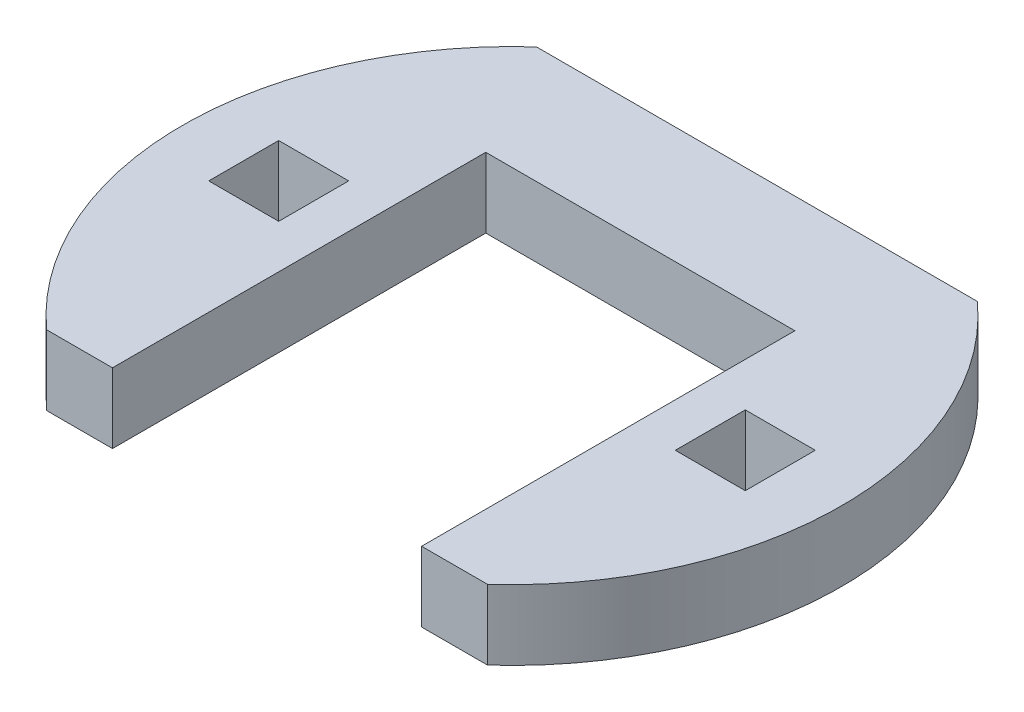
ISO-10303-21;
HEADER;
FILE_DESCRIPTION(('STEP AP214'),'2;1');
FILE_NAME('part.step','',(''),(''),'','','');
FILE_SCHEMA(('AUTOMOTIVE_DESIGN { 1 0 10303 214 1 1 1 1 }'));
ENDSEC;
DATA;
#1=APPLICATION_CONTEXT('core data for automotive mechanical design processes');
#2=APPLICATION_PROTOCOL_DEFINITION('international standard','automotive_design',2000,#1);
#3=PRODUCT_CONTEXT('',#1,'mechanical');
#4=PRODUCT('Part','Part','',(#3));
#5=PRODUCT_RELATED_PRODUCT_CATEGORY('part','',(#4));
#6=PRODUCT_DEFINITION_FORMATION('','',#4);
#7=PRODUCT_DEFINITION_CONTEXT('part definition',#1,'design');
#8=PRODUCT_DEFINITION('design','',#6,#7);
#9=PRODUCT_DEFINITION_SHAPE('','',#8);
#10=(LENGTH_UNIT() NAMED_UNIT(*) SI_UNIT(.MILLI.,.METRE.));
#11=(NAMED_UNIT(*) PLANE_ANGLE_UNIT() SI_UNIT($,.RADIAN.));
#12=(NAMED_UNIT(*) SI_UNIT($,.STERADIAN.) SOLID_ANGLE_UNIT());
#13=UNCERTAINTY_MEASURE_WITH_UNIT(LENGTH_MEASURE(1.E-05),#10,'distance_accuracy_value','');
#14=(GEOMETRIC_REPRESENTATION_CONTEXT(3) GLOBAL_UNCERTAINTY_ASSIGNED_CONTEXT((#13)) GLOBAL_UNIT_ASSIGNED_CONTEXT((#10,
#11,#12)) REPRESENTATION_CONTEXT('',''));
#15=CARTESIAN_POINT('',(0.,0.,0.));
#16=DIRECTION('',(0.,0.,1.));
#17=DIRECTION('',(1.,0.,0.));
#18=AXIS2_PLACEMENT_3D('',#15,#16,#17);
#19=CARTESIAN_POINT('',(23.,6.,3.00000000000001));
#20=DIRECTION('',(1.,0.,0.));
#21=DIRECTION('',(0.,0.,-1.));
#22=AXIS2_PLACEMENT_3D('',#19,#20,#21);
#23=PLANE('',#22);
#24=DIRECTION('',(0.,-1.,0.));
#25=VECTOR('',#24,1.);
#26=CARTESIAN_POINT('',(23.,6.,-2.99999999999999));
#27=LINE('',#26,#25);
#28=CARTESIAN_POINT('',(23.,-6.,-2.99999999999999));
#29=VERTEX_POINT('',#28);
#30=CARTESIAN_POINT('',(23.,-12.,-2.99999999999999));
#31=VERTEX_POINT('',#30);
#32=EDGE_CURVE('E239',#29,#31,#27,.T.);
#33=ORIENTED_EDGE('',*,*,#32,.T.);
#34=DIRECTION('',(0.,0.,1.));
#35=VECTOR('',#34,1.);
#36=CARTESIAN_POINT('',(23.,-12.,3.00000000000001));
#37=LINE('',#36,#35);
#38=CARTESIAN_POINT('',(23.,-12.,3.00000000000001));
#39=VERTEX_POINT('',#38);
#40=EDGE_CURVE('E263',#31,#39,#37,.T.);
#41=ORIENTED_EDGE('',*,*,#40,.T.);
#42=DIRECTION('',(0.,-1.,0.));
#43=VECTOR('',#42,1.);
#44=CARTESIAN_POINT('',(23.,6.,3.00000000000001));
#45=LINE('',#44,#43);
#46=CARTESIAN_POINT('',(23.,-6.,3.00000000000001));
#47=VERTEX_POINT('',#46);
#48=EDGE_CURVE('E229',#47,#39,#45,.T.);
#49=ORIENTED_EDGE('',*,*,#48,.F.);
#50=DIRECTION('',(0.,0.,1.));
#51=VECTOR('',#50,1.);
#52=CARTESIAN_POINT('',(23.,-6.,3.00000000000001));
#53=LINE('',#52,#51);
#54=EDGE_CURVE('E233',#29,#47,#53,.T.);
#55=ORIENTED_EDGE('',*,*,#54,.F.);
#56=EDGE_LOOP('',(#33,#41,#49,#55));
#57=FACE_BOUND('',#56,.T.);
#58=ADVANCED_FACE('F37',(#57),#23,.F.);
#59=CARTESIAN_POINT('',(23.,6.,-2.99999999999999));
#60=DIRECTION('',(0.,0.,-1.));
#61=DIRECTION('',(-1.,0.,0.));
#62=AXIS2_PLACEMENT_3D('',#59,#60,#61);
#63=PLANE('',#62);
#64=DIRECTION('',(0.,-1.,0.));
#65=VECTOR('',#64,1.);
#66=CARTESIAN_POINT('',(17.,6.,-2.99999999999999));
#67=LINE('',#66,#65);
#68=CARTESIAN_POINT('',(17.,-6.,-2.99999999999999));
#69=VERTEX_POINT('',#68);
#70=CARTESIAN_POINT('',(17.,-12.,-2.99999999999999));
#71=VERTEX_POINT('',#70);
#72=EDGE_CURVE('E236',#69,#71,#67,.T.);
#73=ORIENTED_EDGE('',*,*,#72,.T.);
#74=DIRECTION('',(1.,0.,0.));
#75=VECTOR('',#74,1.);
#76=CARTESIAN_POINT('',(23.,-12.,-2.99999999999999));
#77=LINE('',#76,#75);
#78=EDGE_CURVE('E266',#71,#31,#77,.T.);
#79=ORIENTED_EDGE('',*,*,#78,.T.);
#80=ORIENTED_EDGE('',*,*,#32,.F.);
#81=DIRECTION('',(1.,0.,0.));
#82=VECTOR('',#81,1.);
#83=CARTESIAN_POINT('',(23.,-6.,-2.99999999999999));
#84=LINE('',#83,#82);
#85=EDGE_CURVE('E251',#69,#29,#84,.T.);
#86=ORIENTED_EDGE('',*,*,#85,.F.);
#87=EDGE_LOOP('',(#73,#79,#80,#86));
#88=FACE_BOUND('',#87,.T.);
#89=ADVANCED_FACE('F304',(#88),#63,.F.);
#90=CARTESIAN_POINT('',(17.,6.,3.00000000000001));
#91=DIRECTION('',(-1.,0.,0.));
#92=DIRECTION('',(0.,0.,1.));
#93=AXIS2_PLACEMENT_3D('',#90,#91,#92);
#94=PLANE('',#93);
#95=DIRECTION('',(0.,-1.,0.));
#96=VECTOR('',#95,1.);
#97=CARTESIAN_POINT('',(17.,6.,3.00000000000001));
#98=LINE('',#97,#96);
#99=CARTESIAN_POINT('',(17.,-6.,3.00000000000001));
#100=VERTEX_POINT('',#99);
#101=CARTESIAN_POINT('',(17.,-12.,3.00000000000001));
#102=VERTEX_POINT('',#101);
#103=EDGE_CURVE('E232',#100,#102,#98,.T.);
#104=ORIENTED_EDGE('',*,*,#103,.T.);
#105=DIRECTION('',(0.,0.,-1.));
#106=VECTOR('',#105,1.);
#107=CARTESIAN_POINT('',(17.,-12.,3.00000000000001));
#108=LINE('',#107,#106);
#109=EDGE_CURVE('E52',#102,#71,#108,.T.);
#110=ORIENTED_EDGE('',*,*,#109,.T.);
#111=ORIENTED_EDGE('',*,*,#72,.F.);
#112=DIRECTION('',(0.,0.,-1.));
#113=VECTOR('',#112,1.);
#114=CARTESIAN_POINT('',(17.,-6.,3.00000000000001));
#115=LINE('',#114,#113);
#116=EDGE_CURVE('E253',#100,#69,#115,.T.);
#117=ORIENTED_EDGE('',*,*,#116,.F.);
#118=EDGE_LOOP('',(#104,#110,#111,#117));
#119=FACE_BOUND('',#118,.T.);
#120=ADVANCED_FACE('F310',(#119),#94,.F.);
#121=CARTESIAN_POINT('',(23.,6.,3.00000000000001));
#122=DIRECTION('',(0.,0.,1.));
#123=DIRECTION('',(1.,0.,0.));
#124=AXIS2_PLACEMENT_3D('',#121,#122,#123);
#125=PLANE('',#124);
#126=ORIENTED_EDGE('',*,*,#48,.T.);
#127=DIRECTION('',(-1.,0.,0.));
#128=VECTOR('',#127,1.);
#129=CARTESIAN_POINT('',(23.,-12.,3.00000000000001));
#130=LINE('',#129,#128);
#131=EDGE_CURVE('E270',#39,#102,#130,.T.);
#132=ORIENTED_EDGE('',*,*,#131,.T.);
#133=ORIENTED_EDGE('',*,*,#103,.F.);
#134=DIRECTION('',(-1.,0.,0.));
#135=VECTOR('',#134,1.);
#136=CARTESIAN_POINT('',(23.,-6.,3.00000000000001));
#137=LINE('',#136,#135);
#138=EDGE_CURVE('E255',#47,#100,#137,.T.);
#139=ORIENTED_EDGE('',*,*,#138,.F.);
#140=EDGE_LOOP('',(#126,#132,#133,#139));
#141=FACE_BOUND('',#140,.T.);
#142=ADVANCED_FACE('F315',(#141),#125,.F.);
#143=CARTESIAN_POINT('',(-17.,6.,3.));
#144=DIRECTION('',(1.,0.,0.));
#145=DIRECTION('',(0.,0.,-1.));
#146=AXIS2_PLACEMENT_3D('',#143,#144,#145);
#147=PLANE('',#146);
#148=DIRECTION('',(0.,-1.,0.));
#149=VECTOR('',#148,1.);
#150=CARTESIAN_POINT('',(-17.,6.,-3.));
#151=LINE('',#150,#149);
#152=CARTESIAN_POINT('',(-17.,-6.,-3.));
#153=VERTEX_POINT('',#152);
#154=CARTESIAN_POINT('',(-17.,-12.,-3.));
#155=VERTEX_POINT('',#154);
#156=EDGE_CURVE('E202',#153,#155,#151,.T.);
#157=ORIENTED_EDGE('',*,*,#156,.T.);
#158=DIRECTION('',(0.,0.,1.));
#159=VECTOR('',#158,1.);
#160=CARTESIAN_POINT('',(-17.,-12.,3.));
#161=LINE('',#160,#159);
#162=CARTESIAN_POINT('',(-17.,-12.,3.));
#163=VERTEX_POINT('',#162);
#164=EDGE_CURVE('E272',#155,#163,#161,.T.);
#165=ORIENTED_EDGE('',*,*,#164,.T.);
#166=DIRECTION('',(0.,-1.,0.));
#167=VECTOR('',#166,1.);
#168=CARTESIAN_POINT('',(-17.,6.,3.));
#169=LINE('',#168,#167);
#170=CARTESIAN_POINT('',(-17.,-6.,3.));
#171=VERTEX_POINT('',#170);
#172=EDGE_CURVE('E242',#171,#163,#169,.T.);
#173=ORIENTED_EDGE('',*,*,#172,.F.);
#174=DIRECTION('',(0.,0.,1.));
#175=VECTOR('',#174,1.);
#176=CARTESIAN_POINT('',(-17.,-6.,3.));
#177=LINE('',#176,#175);
#178=EDGE_CURVE('E257',#153,#171,#177,.T.);
#179=ORIENTED_EDGE('',*,*,#178,.F.);
#180=EDGE_LOOP('',(#157,#165,#173,#179));
#181=FACE_BOUND('',#180,.T.);
#182=ADVANCED_FACE('F383',(#181),#147,.F.);
#183=CARTESIAN_POINT('',(-23.,6.,-3.));
#184=DIRECTION('',(0.,0.,-1.));
#185=DIRECTION('',(-1.,0.,0.));
#186=AXIS2_PLACEMENT_3D('',#183,#184,#185);
#187=PLANE('',#186);
#188=DIRECTION('',(0.,-1.,0.));
#189=VECTOR('',#188,1.);
#190=CARTESIAN_POINT('',(-23.,6.,-3.));
#191=LINE('',#190,#189);
#192=CARTESIAN_POINT('',(-23.,-6.,-3.));
#193=VERTEX_POINT('',#192);
#194=CARTESIAN_POINT('',(-23.,-12.,-3.));
#195=VERTEX_POINT('',#194);
#196=EDGE_CURVE('E207',#193,#195,#191,.T.);
#197=ORIENTED_EDGE('',*,*,#196,.T.);
#198=DIRECTION('',(1.,0.,0.));
#199=VECTOR('',#198,1.);
#200=CARTESIAN_POINT('',(-23.,-12.,-3.));
#201=LINE('',#200,#199);
#202=EDGE_CURVE('E275',#195,#155,#201,.T.);
#203=ORIENTED_EDGE('',*,*,#202,.T.);
#204=ORIENTED_EDGE('',*,*,#156,.F.);
#205=DIRECTION('',(1.,0.,0.));
#206=VECTOR('',#205,1.);
#207=CARTESIAN_POINT('',(-23.,-6.,-3.));
#208=LINE('',#207,#206);
#209=EDGE_CURVE('E259',#193,#153,#208,.T.);
#210=ORIENTED_EDGE('',*,*,#209,.F.);
#211=EDGE_LOOP('',(#197,#203,#204,#210));
#212=FACE_BOUND('',#211,.T.);
#213=ADVANCED_FACE('F391',(#212),#187,.F.);
#214=CARTESIAN_POINT('',(-23.,6.,3.));
#215=DIRECTION('',(-1.,0.,0.));
#216=DIRECTION('',(0.,0.,1.));
#217=AXIS2_PLACEMENT_3D('',#214,#215,#216);
#218=PLANE('',#217);
#219=DIRECTION('',(0.,-1.,0.));
#220=VECTOR('',#219,1.);
#221=CARTESIAN_POINT('',(-23.,6.,3.));
#222=LINE('',#221,#220);
#223=CARTESIAN_POINT('',(-23.,-6.,3.));
#224=VERTEX_POINT('',#223);
#225=CARTESIAN_POINT('',(-23.,-12.,3.));
#226=VERTEX_POINT('',#225);
#227=EDGE_CURVE('E245',#224,#226,#222,.T.);
#228=ORIENTED_EDGE('',*,*,#227,.T.);
#229=DIRECTION('',(0.,0.,-1.));
#230=VECTOR('',#229,1.);
#231=CARTESIAN_POINT('',(-23.,-12.,3.));
#232=LINE('',#231,#230);
#233=EDGE_CURVE('E60',#226,#195,#232,.T.);
#234=ORIENTED_EDGE('',*,*,#233,.T.);
#235=ORIENTED_EDGE('',*,*,#196,.F.);
#236=DIRECTION('',(0.,0.,-1.));
#237=VECTOR('',#236,1.);
#238=CARTESIAN_POINT('',(-23.,-6.,3.));
#239=LINE('',#238,#237);
#240=EDGE_CURVE('E261',#224,#193,#239,.T.);
#241=ORIENTED_EDGE('',*,*,#240,.F.);
#242=EDGE_LOOP('',(#228,#234,#235,#241));
#243=FACE_BOUND('',#242,.T.);
#244=ADVANCED_FACE('F400',(#243),#218,.F.);
#245=CARTESIAN_POINT('',(-23.,6.,3.));
#246=DIRECTION('',(0.,0.,1.));
#247=DIRECTION('',(1.,0.,0.));
#248=AXIS2_PLACEMENT_3D('',#245,#246,#247);
#249=PLANE('',#248);
#250=ORIENTED_EDGE('',*,*,#172,.T.);
#251=DIRECTION('',(-1.,0.,0.));
#252=VECTOR('',#251,1.);
#253=CARTESIAN_POINT('',(-23.,-12.,3.));
#254=LINE('',#253,#252);
#255=EDGE_CURVE('E279',#163,#226,#254,.T.);
#256=ORIENTED_EDGE('',*,*,#255,.T.);
#257=ORIENTED_EDGE('',*,*,#227,.F.);
#258=DIRECTION('',(-1.,0.,0.));
#259=VECTOR('',#258,1.);
#260=CARTESIAN_POINT('',(-23.,-6.,3.));
#261=LINE('',#260,#259);
#262=EDGE_CURVE('E11',#171,#224,#261,.T.);
#263=ORIENTED_EDGE('',*,*,#262,.F.);
#264=EDGE_LOOP('',(#250,#256,#257,#263));
#265=FACE_BOUND('',#264,.T.);
#266=ADVANCED_FACE('F409',(#265),#249,.F.);
#267=CARTESIAN_POINT('',(-13.25,-12.,-11.));
#268=DIRECTION('',(0.,0.,-1.));
#269=DIRECTION('',(-1.,0.,0.));
#270=AXIS2_PLACEMENT_3D('',#267,#268,#269);
#271=PLANE('',#270);
#272=DIRECTION('',(-1.,0.,0.));
#273=VECTOR('',#272,1.);
#274=CARTESIAN_POINT('',(-13.25,-6.,-11.));
#275=LINE('',#274,#273);
#276=CARTESIAN_POINT('',(13.25,-6.,-11.));
#277=VERTEX_POINT('',#276);
#278=CARTESIAN_POINT('',(-13.25,-6.,-11.));
#279=VERTEX_POINT('',#278);
#280=EDGE_CURVE('E197',#277,#279,#275,.T.);
#281=ORIENTED_EDGE('',*,*,#280,.T.);
#282=DIRECTION('',(0.,1.,0.));
#283=VECTOR('',#282,1.);
#284=CARTESIAN_POINT('',(-13.25,-12.,-11.));
#285=LINE('',#284,#283);
#286=CARTESIAN_POINT('',(-13.25,-12.,-11.));
#287=VERTEX_POINT('',#286);
#288=EDGE_CURVE('E45',#287,#279,#285,.T.);
#289=ORIENTED_EDGE('',*,*,#288,.F.);
#290=DIRECTION('',(-1.,0.,0.));
#291=VECTOR('',#290,1.);
#292=CARTESIAN_POINT('',(-13.25,-12.,-11.));
#293=LINE('',#292,#291);
#294=CARTESIAN_POINT('',(13.25,-12.,-11.));
#295=VERTEX_POINT('',#294);
#296=EDGE_CURVE('E225',#295,#287,#293,.T.);
#297=ORIENTED_EDGE('',*,*,#296,.F.);
#298=DIRECTION('',(0.,1.,0.));
#299=VECTOR('',#298,1.);
#300=CARTESIAN_POINT('',(13.25,-12.,-11.));
#301=LINE('',#300,#299);
#302=EDGE_CURVE('E176',#295,#277,#301,.T.);
#303=ORIENTED_EDGE('',*,*,#302,.T.);
#304=EDGE_LOOP('',(#281,#289,#297,#303));
#305=FACE_BOUND('',#304,.T.);
#306=ADVANCED_FACE('F39',(#305),#271,.F.);
#307=CARTESIAN_POINT('',(-13.25,-12.,21.));
#308=DIRECTION('',(-1.,0.,0.));
#309=DIRECTION('',(0.,0.,1.));
#310=AXIS2_PLACEMENT_3D('',#307,#308,#309);
#311=PLANE('',#310);
#312=DIRECTION('',(0.,1.,0.));
#313=VECTOR('',#312,1.);
#314=CARTESIAN_POINT('',(-13.25,-12.,21.));
#315=LINE('',#314,#313);
#316=CARTESIAN_POINT('',(-13.25,-12.,21.));
#317=VERTEX_POINT('',#316);
#318=CARTESIAN_POINT('',(-13.25,-6.,21.));
#319=VERTEX_POINT('',#318);
#320=EDGE_CURVE('E183',#317,#319,#315,.T.);
#321=ORIENTED_EDGE('',*,*,#320,.F.);
#322=DIRECTION('',(0.,0.,1.));
#323=VECTOR('',#322,1.);
#324=CARTESIAN_POINT('',(-13.25,-12.,21.));
#325=LINE('',#324,#323);
#326=EDGE_CURVE('E193',#287,#317,#325,.T.);
#327=ORIENTED_EDGE('',*,*,#326,.F.);
#328=ORIENTED_EDGE('',*,*,#288,.T.);
#329=DIRECTION('',(0.,0.,1.));
#330=VECTOR('',#329,1.);
#331=CARTESIAN_POINT('',(-13.25,-6.,21.));
#332=LINE('',#331,#330);
#333=EDGE_CURVE('E192',#279,#319,#332,.T.);
#334=ORIENTED_EDGE('',*,*,#333,.T.);
#335=EDGE_LOOP('',(#321,#327,#328,#334));
#336=FACE_BOUND('',#335,.T.);
#337=ADVANCED_FACE('F191',(#336),#311,.F.);
#338=CARTESIAN_POINT('',(-18.8960974806969,-12.,21.));
#339=DIRECTION('',(0.,0.,-1.));
#340=DIRECTION('',(-1.,0.,0.));
#341=AXIS2_PLACEMENT_3D('',#338,#339,#340);
#342=PLANE('',#341);
#343=DIRECTION('',(0.,1.,0.));
#344=VECTOR('',#343,1.);
#345=CARTESIAN_POINT('',(-18.8960974806969,-12.,21.));
#346=LINE('',#345,#344);
#347=CARTESIAN_POINT('',(-18.8960974806969,-12.,21.));
#348=VERTEX_POINT('',#347);
#349=CARTESIAN_POINT('',(-18.8960974806969,-6.,21.));
#350=VERTEX_POINT('',#349);
#351=EDGE_CURVE('E181',#348,#350,#346,.T.);
#352=ORIENTED_EDGE('',*,*,#351,.F.);
#353=DIRECTION('',(1.,0.,0.));
#354=VECTOR('',#353,1.);
#355=CARTESIAN_POINT('',(-18.8960974806969,-12.,21.));
#356=LINE('',#355,#354);
#357=EDGE_CURVE('E281',#348,#317,#356,.T.);
#358=ORIENTED_EDGE('',*,*,#357,.T.);
#359=ORIENTED_EDGE('',*,*,#320,.T.);
#360=DIRECTION('',(-1.,0.,0.));
#361=VECTOR('',#360,1.);
#362=CARTESIAN_POINT('',(-18.8960974806969,-6.,21.));
#363=LINE('',#362,#361);
#364=EDGE_CURVE('E204',#319,#350,#363,.T.);
#365=ORIENTED_EDGE('',*,*,#364,.T.);
#366=EDGE_LOOP('',(#352,#358,#359,#365));
#367=FACE_BOUND('',#366,.T.);
#368=ADVANCED_FACE('F295',(#367),#342,.F.);
#369=CARTESIAN_POINT('',(0.,-12.,0.));
#370=DIRECTION('',(0.,1.,0.));
#371=DIRECTION('',(0.,0.,1.));
#372=AXIS2_PLACEMENT_3D('',#369,#370,#371);
#373=CYLINDRICAL_SURFACE('',#372,28.25);
#374=DIRECTION('',(0.,1.,0.));
#375=VECTOR('',#374,1.);
#376=CARTESIAN_POINT('',(-18.8960974806969,-12.,-21.));
#377=LINE('',#376,#375);
#378=CARTESIAN_POINT('',(-18.8960974806969,-12.,-21.));
#379=VERTEX_POINT('',#378);
#380=CARTESIAN_POINT('',(-18.8960974806969,-6.,-21.));
#381=VERTEX_POINT('',#380);
#382=EDGE_CURVE('E174',#379,#381,#377,.T.);
#383=ORIENTED_EDGE('',*,*,#382,.F.);
#384=CARTESIAN_POINT('',(0.,-12.,0.));
#385=DIRECTION('',(0.,1.,0.));
#386=DIRECTION('',(0.,0.,1.));
#387=AXIS2_PLACEMENT_3D('',#384,#385,#386);
#388=CIRCLE('',#387,28.25);
#389=EDGE_CURVE('E159',#379,#348,#388,.T.);
#390=ORIENTED_EDGE('',*,*,#389,.T.);
#391=ORIENTED_EDGE('',*,*,#351,.T.);
#392=CARTESIAN_POINT('',(0.,-6.,0.));
#393=DIRECTION('',(0.,-1.,0.));
#394=DIRECTION('',(0.,0.,-1.));
#395=AXIS2_PLACEMENT_3D('',#392,#393,#394);
#396=CIRCLE('',#395,28.25);
#397=EDGE_CURVE('E215',#350,#381,#396,.T.);
#398=ORIENTED_EDGE('',*,*,#397,.T.);
#399=EDGE_LOOP('',(#383,#390,#391,#398));
#400=FACE_BOUND('',#399,.T.);
#401=ADVANCED_FACE('F289',(#400),#373,.T.);
#402=CARTESIAN_POINT('',(18.8960974806969,-12.,-21.));
#403=DIRECTION('',(0.,0.,1.));
#404=DIRECTION('',(1.,0.,0.));
#405=AXIS2_PLACEMENT_3D('',#402,#403,#404);
#406=PLANE('',#405);
#407=DIRECTION('',(0.,1.,0.));
#408=VECTOR('',#407,1.);
#409=CARTESIAN_POINT('',(18.8960974806969,-12.,-21.));
#410=LINE('',#409,#408);
#411=CARTESIAN_POINT('',(18.8960974806969,-12.,-21.));
#412=VERTEX_POINT('',#411);
#413=CARTESIAN_POINT('',(18.8960974806969,-6.,-21.));
#414=VERTEX_POINT('',#413);
#415=EDGE_CURVE('E172',#412,#414,#410,.T.);
#416=ORIENTED_EDGE('',*,*,#415,.F.);
#417=DIRECTION('',(-1.,0.,0.));
#418=VECTOR('',#417,1.);
#419=CARTESIAN_POINT('',(18.8960974806969,-12.,-21.));
#420=LINE('',#419,#418);
#421=EDGE_CURVE('E155',#412,#379,#420,.T.);
#422=ORIENTED_EDGE('',*,*,#421,.T.);
#423=ORIENTED_EDGE('',*,*,#382,.T.);
#424=DIRECTION('',(1.,0.,0.));
#425=VECTOR('',#424,1.);
#426=CARTESIAN_POINT('',(18.8960974806969,-6.,-21.));
#427=LINE('',#426,#425);
#428=EDGE_CURVE('E218',#381,#414,#427,.T.);
#429=ORIENTED_EDGE('',*,*,#428,.T.);
#430=EDGE_LOOP('',(#416,#422,#423,#429));
#431=FACE_BOUND('',#430,.T.);
#432=ADVANCED_FACE('F285',(#431),#406,.F.);
#433=CARTESIAN_POINT('',(0.,-12.,0.));
#434=DIRECTION('',(0.,1.,0.));
#435=DIRECTION('',(0.,0.,1.));
#436=AXIS2_PLACEMENT_3D('',#433,#434,#435);
#437=CYLINDRICAL_SURFACE('',#436,28.25);
#438=DIRECTION('',(0.,1.,0.));
#439=VECTOR('',#438,1.);
#440=CARTESIAN_POINT('',(18.8960974806969,-12.,21.));
#441=LINE('',#440,#439);
#442=CARTESIAN_POINT('',(18.8960974806969,-12.,21.));
#443=VERTEX_POINT('',#442);
#444=CARTESIAN_POINT('',(18.8960974806969,-6.,21.));
#445=VERTEX_POINT('',#444);
#446=EDGE_CURVE('E164',#443,#445,#441,.T.);
#447=ORIENTED_EDGE('',*,*,#446,.F.);
#448=EDGE_CURVE('E149',#443,#412,#388,.T.);
#449=ORIENTED_EDGE('',*,*,#448,.T.);
#450=ORIENTED_EDGE('',*,*,#415,.T.);
#451=CARTESIAN_POINT('',(0.,-6.,0.));
#452=DIRECTION('',(0.,-1.,0.));
#453=DIRECTION('',(0.,0.,1.));
#454=AXIS2_PLACEMENT_3D('',#451,#452,#453);
#455=CIRCLE('',#454,28.25);
#456=EDGE_CURVE('E171',#414,#445,#455,.T.);
#457=ORIENTED_EDGE('',*,*,#456,.T.);
#458=EDGE_LOOP('',(#447,#449,#450,#457));
#459=FACE_BOUND('',#458,.T.);
#460=ADVANCED_FACE('F169',(#459),#437,.T.);
#461=CARTESIAN_POINT('',(13.25,-12.,21.));
#462=DIRECTION('',(0.,0.,-1.));
#463=DIRECTION('',(-1.,0.,0.));
#464=AXIS2_PLACEMENT_3D('',#461,#462,#463);
#465=PLANE('',#464);
#466=DIRECTION('',(0.,1.,0.));
#467=VECTOR('',#466,1.);
#468=CARTESIAN_POINT('',(13.25,-12.,21.));
#469=LINE('',#468,#467);
#470=CARTESIAN_POINT('',(13.25,-12.,21.));
#471=VERTEX_POINT('',#470);
#472=CARTESIAN_POINT('',(13.25,-6.,21.));
#473=VERTEX_POINT('',#472);
#474=EDGE_CURVE('E166',#471,#473,#469,.T.);
#475=ORIENTED_EDGE('',*,*,#474,.F.);
#476=DIRECTION('',(1.,0.,0.));
#477=VECTOR('',#476,1.);
#478=CARTESIAN_POINT('',(13.25,-12.,21.));
#479=LINE('',#478,#477);
#480=EDGE_CURVE('E152',#471,#443,#479,.T.);
#481=ORIENTED_EDGE('',*,*,#480,.T.);
#482=ORIENTED_EDGE('',*,*,#446,.T.);
#483=DIRECTION('',(-1.,0.,0.));
#484=VECTOR('',#483,1.);
#485=CARTESIAN_POINT('',(13.25,-6.,21.));
#486=LINE('',#485,#484);
#487=EDGE_CURVE('E222',#445,#473,#486,.T.);
#488=ORIENTED_EDGE('',*,*,#487,.T.);
#489=EDGE_LOOP('',(#475,#481,#482,#488));
#490=FACE_BOUND('',#489,.T.);
#491=ADVANCED_FACE('F162',(#490),#465,.F.);
#492=CARTESIAN_POINT('',(13.25,-12.,-11.));
#493=DIRECTION('',(1.,0.,0.));
#494=DIRECTION('',(0.,0.,-1.));
#495=AXIS2_PLACEMENT_3D('',#492,#493,#494);
#496=PLANE('',#495);
#497=DIRECTION('',(0.,0.,-1.));
#498=VECTOR('',#497,1.);
#499=CARTESIAN_POINT('',(13.25,-12.,-11.));
#500=LINE('',#499,#498);
#501=EDGE_CURVE('E210',#471,#295,#500,.T.);
#502=ORIENTED_EDGE('',*,*,#501,.F.);
#503=ORIENTED_EDGE('',*,*,#474,.T.);
#504=DIRECTION('',(0.,0.,-1.));
#505=VECTOR('',#504,1.);
#506=CARTESIAN_POINT('',(13.25,-6.,-11.));
#507=LINE('',#506,#505);
#508=EDGE_CURVE('E224',#473,#277,#507,.T.);
#509=ORIENTED_EDGE('',*,*,#508,.T.);
#510=ORIENTED_EDGE('',*,*,#302,.F.);
#511=EDGE_LOOP('',(#502,#503,#509,#510));
#512=FACE_BOUND('',#511,.T.);
#513=ADVANCED_FACE('F317',(#512),#496,.F.);
#514=CARTESIAN_POINT('',(0.,-6.,0.));
#515=DIRECTION('',(0.,1.,0.));
#516=DIRECTION('',(0.,0.,1.));
#517=AXIS2_PLACEMENT_3D('',#514,#515,#516);
#518=PLANE('',#517);
#519=ORIENTED_EDGE('',*,*,#54,.T.);
#520=ORIENTED_EDGE('',*,*,#138,.T.);
#521=ORIENTED_EDGE('',*,*,#116,.T.);
#522=ORIENTED_EDGE('',*,*,#85,.T.);
#523=EDGE_LOOP('',(#519,#520,#521,#522));
#524=FACE_BOUND('',#523,.T.);
#525=ORIENTED_EDGE('',*,*,#178,.T.);
#526=ORIENTED_EDGE('',*,*,#262,.T.);
#527=ORIENTED_EDGE('',*,*,#240,.T.);
#528=ORIENTED_EDGE('',*,*,#209,.T.);
#529=EDGE_LOOP('',(#525,#526,#527,#528));
#530=FACE_BOUND('',#529,.T.);
#531=ORIENTED_EDGE('',*,*,#280,.F.);
#532=ORIENTED_EDGE('',*,*,#508,.F.);
#533=ORIENTED_EDGE('',*,*,#487,.F.);
#534=ORIENTED_EDGE('',*,*,#456,.F.);
#535=ORIENTED_EDGE('',*,*,#428,.F.);
#536=ORIENTED_EDGE('',*,*,#397,.F.);
#537=ORIENTED_EDGE('',*,*,#364,.F.);
#538=ORIENTED_EDGE('',*,*,#333,.F.);
#539=EDGE_LOOP('',(#531,#532,#533,#534,#535,#536,#537,#538));
#540=FACE_BOUND('',#539,.T.);
#541=ADVANCED_FACE('F293',(#524,#530,#540),#518,.T.);
#542=CARTESIAN_POINT('',(0.,-12.,0.));
#543=DIRECTION('',(0.,1.,0.));
#544=DIRECTION('',(0.,0.,1.));
#545=AXIS2_PLACEMENT_3D('',#542,#543,#544);
#546=PLANE('',#545);
#547=ORIENTED_EDGE('',*,*,#357,.F.);
#548=ORIENTED_EDGE('',*,*,#389,.F.);
#549=ORIENTED_EDGE('',*,*,#421,.F.);
#550=ORIENTED_EDGE('',*,*,#448,.F.);
#551=ORIENTED_EDGE('',*,*,#480,.F.);
#552=ORIENTED_EDGE('',*,*,#501,.T.);
#553=ORIENTED_EDGE('',*,*,#296,.T.);
#554=ORIENTED_EDGE('',*,*,#326,.T.);
#555=EDGE_LOOP('',(#547,#548,#549,#550,#551,#552,#553,#554));
#556=FACE_BOUND('',#555,.T.);
#557=ORIENTED_EDGE('',*,*,#202,.F.);
#558=ORIENTED_EDGE('',*,*,#233,.F.);
#559=ORIENTED_EDGE('',*,*,#255,.F.);
#560=ORIENTED_EDGE('',*,*,#164,.F.);
#561=EDGE_LOOP('',(#557,#558,#559,#560));
#562=FACE_BOUND('',#561,.T.);
#563=ORIENTED_EDGE('',*,*,#78,.F.);
#564=ORIENTED_EDGE('',*,*,#109,.F.);
#565=ORIENTED_EDGE('',*,*,#131,.F.);
#566=ORIENTED_EDGE('',*,*,#40,.F.);
#567=EDGE_LOOP('',(#563,#564,#565,#566));
#568=FACE_BOUND('',#567,.T.);
#569=ADVANCED_FACE('F151',(#556,#562,#568),#546,.F.);
#570=CLOSED_SHELL('',(#58,#89,#120,#142,#182,#213,#244,#266,#306,#337,#368,#401,#432,#460,#491,
#513,#541,#569));
#571=MANIFOLD_SOLID_BREP('B2',#570);
#572=ADVANCED_BREP_SHAPE_REPRESENTATION('',(#18,#571),#14);
#573=SHAPE_DEFINITION_REPRESENTATION(#9,#572);
ENDSEC;
END-ISO-10303-21;
